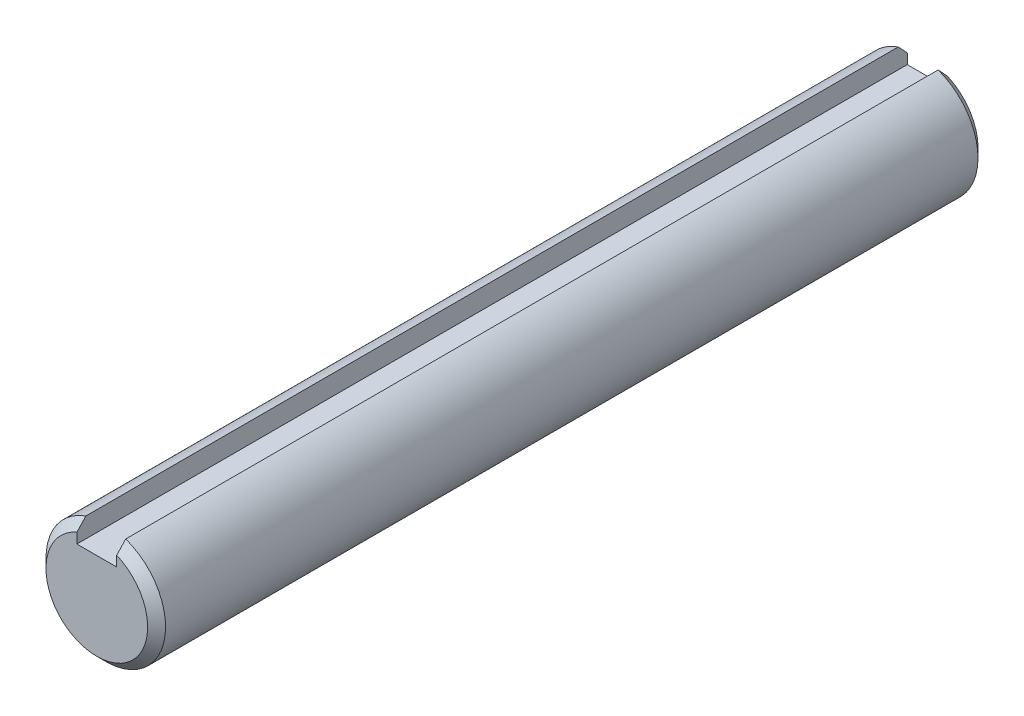
ISO-10303-21;
HEADER;
FILE_DESCRIPTION(('STEP AP214'),'2;1');
FILE_NAME('part.step','',(''),(''),'','','');
FILE_SCHEMA(('AUTOMOTIVE_DESIGN { 1 0 10303 214 1 1 1 1 }'));
ENDSEC;
DATA;
#1=APPLICATION_CONTEXT('core data for automotive mechanical design processes');
#2=APPLICATION_PROTOCOL_DEFINITION('international standard','automotive_design',2000,#1);
#3=PRODUCT_CONTEXT('',#1,'mechanical');
#4=PRODUCT('Part','Part','',(#3));
#5=PRODUCT_RELATED_PRODUCT_CATEGORY('part','',(#4));
#6=PRODUCT_DEFINITION_FORMATION('','',#4);
#7=PRODUCT_DEFINITION_CONTEXT('part definition',#1,'design');
#8=PRODUCT_DEFINITION('design','',#6,#7);
#9=PRODUCT_DEFINITION_SHAPE('','',#8);
#10=(LENGTH_UNIT() NAMED_UNIT(*) SI_UNIT(.MILLI.,.METRE.));
#11=(NAMED_UNIT(*) PLANE_ANGLE_UNIT() SI_UNIT($,.RADIAN.));
#12=(NAMED_UNIT(*) SI_UNIT($,.STERADIAN.) SOLID_ANGLE_UNIT());
#13=UNCERTAINTY_MEASURE_WITH_UNIT(LENGTH_MEASURE(1.E-05),#10,'distance_accuracy_value','');
#14=(GEOMETRIC_REPRESENTATION_CONTEXT(3) GLOBAL_UNCERTAINTY_ASSIGNED_CONTEXT((#13)) GLOBAL_UNIT_ASSIGNED_CONTEXT((#10,
#11,#12)) REPRESENTATION_CONTEXT('',''));
#15=CARTESIAN_POINT('',(0.,0.,0.));
#16=DIRECTION('',(0.,0.,1.));
#17=DIRECTION('',(1.,0.,0.));
#18=AXIS2_PLACEMENT_3D('',#15,#16,#17);
#19=CARTESIAN_POINT('',(0.,0.,62.5));
#20=DIRECTION('',(0.,0.,-1.));
#21=DIRECTION('',(-1.,0.,0.));
#22=AXIS2_PLACEMENT_3D('',#19,#20,#21);
#23=CYLINDRICAL_SURFACE('',#22,9.);
#24=CARTESIAN_POINT('',(0.,0.,61.15));
#25=DIRECTION('',(0.,0.,1.));
#26=DIRECTION('',(1.,0.,0.));
#27=AXIS2_PLACEMENT_3D('',#24,#25,#26);
#28=CIRCLE('',#27,9.);
#29=CARTESIAN_POINT('',(3.,8.48528137423857,61.15));
#30=VERTEX_POINT('',#29);
#31=CARTESIAN_POINT('',(-3.,8.48528137423857,61.15));
#32=VERTEX_POINT('',#31);
#33=EDGE_CURVE('E174',#30,#32,#28,.F.);
#34=ORIENTED_EDGE('',*,*,#33,.T.);
#35=DIRECTION('',(0.,0.,-1.));
#36=VECTOR('',#35,1.);
#37=CARTESIAN_POINT('',(-3.,8.48528137423857,62.5));
#38=LINE('',#37,#36);
#39=CARTESIAN_POINT('',(-3.,8.48528137423857,-61.15));
#40=VERTEX_POINT('',#39);
#41=EDGE_CURVE('E147',#32,#40,#38,.T.);
#42=ORIENTED_EDGE('',*,*,#41,.T.);
#43=CARTESIAN_POINT('',(0.,0.,-61.15));
#44=DIRECTION('',(0.,0.,1.));
#45=DIRECTION('',(1.,0.,0.));
#46=AXIS2_PLACEMENT_3D('',#43,#44,#45);
#47=CIRCLE('',#46,9.);
#48=CARTESIAN_POINT('',(3.,8.48528137423857,-61.15));
#49=VERTEX_POINT('',#48);
#50=EDGE_CURVE('E170',#40,#49,#47,.T.);
#51=ORIENTED_EDGE('',*,*,#50,.T.);
#52=DIRECTION('',(0.,0.,-1.));
#53=VECTOR('',#52,1.);
#54=CARTESIAN_POINT('',(3.,8.48528137423857,62.5));
#55=LINE('',#54,#53);
#56=EDGE_CURVE('E134',#49,#30,#55,.F.);
#57=ORIENTED_EDGE('',*,*,#56,.T.);
#58=EDGE_LOOP('',(#34,#42,#51,#57));
#59=FACE_BOUND('',#58,.T.);
#60=ADVANCED_FACE('F39',(#59),#23,.T.);
#61=CARTESIAN_POINT('',(0.,0.,62.5));
#62=DIRECTION('',(0.,0.,1.));
#63=DIRECTION('',(1.,0.,0.));
#64=AXIS2_PLACEMENT_3D('',#61,#62,#63);
#65=PLANE('',#64);
#66=DIRECTION('',(0.,-1.,0.));
#67=VECTOR('',#66,1.);
#68=CARTESIAN_POINT('',(-3.,9.,62.5));
#69=LINE('',#68,#67);
#70=CARTESIAN_POINT('',(-3.,7.03722246344393,62.5));
#71=VERTEX_POINT('',#70);
#72=CARTESIAN_POINT('',(-3.,5.5,62.5));
#73=VERTEX_POINT('',#72);
#74=EDGE_CURVE('E96',#71,#73,#69,.T.);
#75=ORIENTED_EDGE('',*,*,#74,.F.);
#76=CARTESIAN_POINT('',(0.,0.,62.5));
#77=DIRECTION('',(0.,0.,1.));
#78=DIRECTION('',(1.,0.,0.));
#79=AXIS2_PLACEMENT_3D('',#76,#77,#78);
#80=CIRCLE('',#79,7.64999999999999);
#81=CARTESIAN_POINT('',(3.,7.03722246344393,62.5));
#82=VERTEX_POINT('',#81);
#83=EDGE_CURVE('E163',#71,#82,#80,.T.);
#84=ORIENTED_EDGE('',*,*,#83,.T.);
#85=DIRECTION('',(0.,1.,0.));
#86=VECTOR('',#85,1.);
#87=CARTESIAN_POINT('',(3.,9.,62.5));
#88=LINE('',#87,#86);
#89=CARTESIAN_POINT('',(3.,5.5,62.5));
#90=VERTEX_POINT('',#89);
#91=EDGE_CURVE('E61',#90,#82,#88,.T.);
#92=ORIENTED_EDGE('',*,*,#91,.F.);
#93=DIRECTION('',(1.,0.,0.));
#94=VECTOR('',#93,1.);
#95=CARTESIAN_POINT('',(-3.,5.5,62.5));
#96=LINE('',#95,#94);
#97=EDGE_CURVE('E107',#73,#90,#96,.T.);
#98=ORIENTED_EDGE('',*,*,#97,.F.);
#99=EDGE_LOOP('',(#75,#84,#92,#98));
#100=FACE_BOUND('',#99,.T.);
#101=ADVANCED_FACE('F119',(#100),#65,.T.);
#102=CARTESIAN_POINT('',(0.,0.,-62.5));
#103=DIRECTION('',(0.,0.,1.));
#104=DIRECTION('',(1.,0.,0.));
#105=AXIS2_PLACEMENT_3D('',#102,#103,#104);
#106=PLANE('',#105);
#107=CARTESIAN_POINT('',(0.,0.,-62.5));
#108=DIRECTION('',(0.,0.,1.));
#109=DIRECTION('',(1.,0.,0.));
#110=AXIS2_PLACEMENT_3D('',#107,#108,#109);
#111=CIRCLE('',#110,7.64999999999998);
#112=CARTESIAN_POINT('',(3.,7.03722246344391,-62.5));
#113=VERTEX_POINT('',#112);
#114=CARTESIAN_POINT('',(-3.,7.03722246344391,-62.5));
#115=VERTEX_POINT('',#114);
#116=EDGE_CURVE('E166',#113,#115,#111,.F.);
#117=ORIENTED_EDGE('',*,*,#116,.T.);
#118=DIRECTION('',(0.,-1.,0.));
#119=VECTOR('',#118,1.);
#120=CARTESIAN_POINT('',(-3.,9.,-62.5));
#121=LINE('',#120,#119);
#122=CARTESIAN_POINT('',(-3.,5.5,-62.5));
#123=VERTEX_POINT('',#122);
#124=EDGE_CURVE('E123',#115,#123,#121,.T.);
#125=ORIENTED_EDGE('',*,*,#124,.T.);
#126=DIRECTION('',(1.,0.,0.));
#127=VECTOR('',#126,1.);
#128=CARTESIAN_POINT('',(-3.,5.5,-62.5));
#129=LINE('',#128,#127);
#130=CARTESIAN_POINT('',(3.,5.5,-62.5));
#131=VERTEX_POINT('',#130);
#132=EDGE_CURVE('E113',#123,#131,#129,.T.);
#133=ORIENTED_EDGE('',*,*,#132,.T.);
#134=DIRECTION('',(0.,1.,0.));
#135=VECTOR('',#134,1.);
#136=CARTESIAN_POINT('',(3.,9.,-62.5));
#137=LINE('',#136,#135);
#138=EDGE_CURVE('E117',#131,#113,#137,.T.);
#139=ORIENTED_EDGE('',*,*,#138,.T.);
#140=EDGE_LOOP('',(#117,#125,#133,#139));
#141=FACE_BOUND('',#140,.T.);
#142=ADVANCED_FACE('F188',(#141),#106,.F.);
#143=CARTESIAN_POINT('',(0.,0.,-61.15));
#144=DIRECTION('',(0.,0.,1.));
#145=DIRECTION('',(1.,0.,0.));
#146=AXIS2_PLACEMENT_3D('',#143,#144,#145);
#147=CONICAL_SURFACE('',#146,9.,0.78539816339745);
#148=CARTESIAN_POINT('',(-3.,1.28705422175552,-66.885569181352));
#149=CARTESIAN_POINT('',(-3.,1.39416593494413,-66.8432894280085));
#150=CARTESIAN_POINT('',(-3.,1.49970504612448,-66.7972735018724));
#151=CARTESIAN_POINT('',(-3.,1.70779483974035,-66.6991939067308));
#152=CARTESIAN_POINT('',(-3.,1.81034895326579,-66.6471375544168));
#153=CARTESIAN_POINT('',(-3.,2.01250497376191,-66.5384958636934));
#154=CARTESIAN_POINT('',(-3.,2.11211642904182,-66.4819280604578));
#155=CARTESIAN_POINT('',(-3.,2.30915207895779,-66.3650446883122));
#156=CARTESIAN_POINT('',(-3.,2.40657551522026,-66.3047278464544));
#157=CARTESIAN_POINT('',(-3.,2.59888060566875,-66.181528445959));
#158=CARTESIAN_POINT('',(-3.,2.69377470407571,-66.11866521502));
#159=CARTESIAN_POINT('',(-3.,2.88195057215747,-65.9905648359847));
#160=CARTESIAN_POINT('',(-3.,2.9752322255786,-65.9253275177663));
#161=CARTESIAN_POINT('',(-3.,3.25321336712594,-65.7265952545667));
#162=CARTESIAN_POINT('',(-3.,3.43584713067468,-65.590212049234));
#163=CARTESIAN_POINT('',(-3.,3.77483382970658,-65.3292923578594));
#164=CARTESIAN_POINT('',(-3.,3.93165748800274,-65.2053606149217));
#165=CARTESIAN_POINT('',(-3.,4.24287389988172,-64.9544735379188));
#166=CARTESIAN_POINT('',(-3.,4.39726656021094,-64.8275180883307));
#167=CARTESIAN_POINT('',(-3.,4.70407768227169,-64.5713596310665));
#168=CARTESIAN_POINT('',(-3.,4.85649681879047,-64.4421574290075));
#169=CARTESIAN_POINT('',(-3.,5.15980015980948,-64.1819612267925));
#170=CARTESIAN_POINT('',(-3.,5.31068433581819,-64.0509671934824));
#171=CARTESIAN_POINT('',(-3.,5.76315575248961,-63.6544132772478));
#172=CARTESIAN_POINT('',(-3.,6.06286560171806,-63.3867128344436));
#173=CARTESIAN_POINT('',(-3.,6.65892063625382,-62.8475897040517));
#174=CARTESIAN_POINT('',(-3.,6.95526570481031,-62.5761668880225));
#175=CARTESIAN_POINT('',(-3.,7.48087483441551,-62.0904865625212));
#176=CARTESIAN_POINT('',(-3.,7.71060801951142,-61.8767360336497));
#177=CARTESIAN_POINT('',(-3.,8.16891776669348,-61.4480072910026));
#178=CARTESIAN_POINT('',(-3.,8.39749434809234,-61.2330290978547));
#179=CARTESIAN_POINT('',(-3.,9.08186503993764,-60.5866507131353));
#180=CARTESIAN_POINT('',(-3.,9.53629737415059,-60.153809245877));
#181=CARTESIAN_POINT('',(-3.,10.4379308864423,-59.2902613941763));
#182=CARTESIAN_POINT('',(-3.,10.8851574882398,-58.8595814956815));
#183=CARTESIAN_POINT('',(-3.,11.5547479712263,-58.2122881220791));
#184=CARTESIAN_POINT('',(-3.,11.7777321033367,-57.9963157535234));
#185=CARTESIAN_POINT('',(-3.,12.2233453796936,-57.5640051793112));
#186=CARTESIAN_POINT('',(-3.,12.4459745240256,-57.3476669737429));
#187=CARTESIAN_POINT('',(-3.,12.6684554624875,-57.1311765583434));
#188=B_SPLINE_CURVE_WITH_KNOTS('',3,(#148,#149,#150,#151,#152,#153,#154,#155,#156,#157,#158,
#159,#160,#161,#162,#163,#164,#165,#166,#167,#168,#169,#170,#171,#172,#173,#174,#175,#176,#177,
#178,#179,#180,#181,#182,#183,#184,#185,#186,#187),.UNSPECIFIED.,.F.,.F.,(4,2,2,2,2,2,2,2,2,2,2,
2,2,2,2,2,2,2,2,4),(0.,0.345260517163666,0.690107106476345,1.0336731835684,1.37735655910374,
1.71879551786006,2.06025899178169,2.74390904952977,3.34351590462932,3.94314570501065,
4.5425647573687,5.14199491575397,6.34751226495429,7.55307131602838,8.49444752726594,
9.4358079673907,11.3185399991295,13.1811862611621,14.1124720431243,15.0437576004991),.UNSPECIFIED.);
#189=EDGE_CURVE('E69',#115,#40,#188,.T.);
#190=ORIENTED_EDGE('',*,*,#189,.F.);
#191=ORIENTED_EDGE('',*,*,#116,.F.);
#192=CARTESIAN_POINT('',(3.,12.6684554624875,-57.1311765583434));
#193=CARTESIAN_POINT('',(3.,12.4443629858942,-57.3492350925374));
#194=CARTESIAN_POINT('',(3.,12.2201201695381,-57.5671392208842));
#195=CARTESIAN_POINT('',(3.,11.7712744081235,-58.0025754232811));
#196=CARTESIAN_POINT('',(3.,11.5466714637079,-58.220107497994));
#197=CARTESIAN_POINT('',(3.,10.8725460583514,-58.871748423888));
#198=CARTESIAN_POINT('',(3.,10.4223942062384,-59.3052067103101));
#199=CARTESIAN_POINT('',(3.,9.52101749576605,-60.1683756665244));
#200=CARTESIAN_POINT('',(3.,9.06979958531305,-60.5980935757919));
#201=CARTESIAN_POINT('',(3.,8.3901259623755,-61.239964360573));
#202=CARTESIAN_POINT('',(3.,8.16301630644125,-61.4535420787142));
#203=CARTESIAN_POINT('',(3.,7.70764902442766,-61.8794894813408));
#204=CARTESIAN_POINT('',(3.,7.47939135327407,-62.0918591176848));
#205=CARTESIAN_POINT('',(3.,7.02013555419467,-62.5162232094383));
#206=CARTESIAN_POINT('',(3.,6.78912923162492,-62.7282088058439));
#207=CARTESIAN_POINT('',(3.,6.3252355250844,-63.1500519451756));
#208=CARTESIAN_POINT('',(3.,6.09234840304178,-63.359909775546));
#209=CARTESIAN_POINT('',(3.,5.62444332287705,-63.7763822232414));
#210=CARTESIAN_POINT('',(3.,5.38942998766917,-63.9830020258882));
#211=CARTESIAN_POINT('',(3.,4.91579369350942,-64.3923329885421));
#212=CARTESIAN_POINT('',(3.,4.67716896563096,-64.5950421146631));
#213=CARTESIAN_POINT('',(3.,4.31477214811534,-64.8952218033121));
#214=CARTESIAN_POINT('',(3.,4.19285453818266,-64.9949298427842));
#215=CARTESIAN_POINT('',(3.,3.94749315778375,-65.1924413885736));
#216=CARTESIAN_POINT('',(3.,3.82404946978754,-65.2902449970781));
#217=CARTESIAN_POINT('',(3.,3.57547725617887,-65.4833183260671));
#218=CARTESIAN_POINT('',(3.,3.45035142568918,-65.5785915068673));
#219=CARTESIAN_POINT('',(3.,3.19778471242301,-65.7660908490711));
#220=CARTESIAN_POINT('',(3.,3.07034333229034,-65.8583163435805));
#221=CARTESIAN_POINT('',(3.,2.811744169512,-66.039365351446));
#222=CARTESIAN_POINT('',(3.,2.68056683526167,-66.1281610577359));
#223=CARTESIAN_POINT('',(3.,2.4147212106069,-66.3002469626776));
#224=CARTESIAN_POINT('',(3.,2.2800551492524,-66.3835405616245));
#225=CARTESIAN_POINT('',(3.,2.07443625756609,-66.5030599403073));
#226=CARTESIAN_POINT('',(3.,2.00511170562078,-66.5420888626211));
#227=CARTESIAN_POINT('',(3.,1.86525443696877,-66.6179017481584));
#228=CARTESIAN_POINT('',(3.,1.79472190356853,-66.6546860481961));
#229=CARTESIAN_POINT('',(3.,1.65218360515421,-66.725692751653));
#230=CARTESIAN_POINT('',(3.,1.5801750399255,-66.7599095724919));
#231=CARTESIAN_POINT('',(3.,1.43471110691234,-66.8252160061861));
#232=CARTESIAN_POINT('',(3.,1.36125498684718,-66.8563039388428));
#233=CARTESIAN_POINT('',(3.,1.28705422175552,-66.885569181352));
#234=B_SPLINE_CURVE_WITH_KNOTS('',3,(#192,#193,#194,#195,#196,#197,#198,#199,#200,#201,#202,
#203,#204,#205,#206,#207,#208,#209,#210,#211,#212,#213,#214,#215,#216,#217,#218,#219,#220,#221,
#222,#223,#224,#225,#226,#227,#228,#229,#230,#231,#232,#233),.UNSPECIFIED.,.F.,.F.,(4,2,2,2,2,2,
2,2,2,2,2,2,2,2,2,2,2,2,2,2,4),(0.,0.938031249020088,1.87606082527993,3.75080984684274,
5.62009648450805,6.55537289706372,7.49068632238736,8.43127072482423,9.37172632187256,
10.3104787015687,11.2497068219196,11.7221862809691,12.1946403176433,12.6664110152082,
13.1382842710489,13.613407650853,14.0882346035914,14.3268694808719,14.5654684615732,
14.8045720461496,15.0438033507551),.UNSPECIFIED.);
#235=EDGE_CURVE('E139',#49,#113,#234,.T.);
#236=ORIENTED_EDGE('',*,*,#235,.F.);
#237=ORIENTED_EDGE('',*,*,#50,.F.);
#238=EDGE_LOOP('',(#190,#191,#236,#237));
#239=FACE_BOUND('',#238,.T.);
#240=ADVANCED_FACE('F149',(#239),#147,.T.);
#241=CARTESIAN_POINT('',(0.,0.,62.5));
#242=DIRECTION('',(0.,0.,-1.));
#243=DIRECTION('',(-1.,0.,0.));
#244=AXIS2_PLACEMENT_3D('',#241,#242,#243);
#245=CONICAL_SURFACE('',#244,7.64999999999999,0.785398163397455);
#246=CARTESIAN_POINT('',(-3.,12.6684554624874,57.1311765583434));
#247=CARTESIAN_POINT('',(-3.,12.4443629858941,57.3492350925375));
#248=CARTESIAN_POINT('',(-3.,12.2201201695381,57.5671392208843));
#249=CARTESIAN_POINT('',(-3.,11.7712744081235,58.0025754232811));
#250=CARTESIAN_POINT('',(-3.,11.5466714637079,58.220107497994));
#251=CARTESIAN_POINT('',(-3.,10.8725460583513,58.8717484238881));
#252=CARTESIAN_POINT('',(-3.,10.4223942062384,59.3052067103102));
#253=CARTESIAN_POINT('',(-3.,9.52101749576605,60.1683756665245));
#254=CARTESIAN_POINT('',(-3.,9.06979958531304,60.598093575792));
#255=CARTESIAN_POINT('',(-3.,8.3901259623755,61.239964360573));
#256=CARTESIAN_POINT('',(-3.,8.16301630644124,61.4535420787142));
#257=CARTESIAN_POINT('',(-3.,7.70764902442766,61.8794894813408));
#258=CARTESIAN_POINT('',(-3.,7.47939135327407,62.0918591176848));
#259=CARTESIAN_POINT('',(-3.,7.02013555419467,62.5162232094383));
#260=CARTESIAN_POINT('',(-3.,6.78912923162492,62.7282088058439));
#261=CARTESIAN_POINT('',(-3.,6.32523552508441,63.1500519451756));
#262=CARTESIAN_POINT('',(-3.,6.09234840304178,63.359909775546));
#263=CARTESIAN_POINT('',(-3.,5.62444332287705,63.7763822232414));
#264=CARTESIAN_POINT('',(-3.,5.38942998766917,63.9830020258882));
#265=CARTESIAN_POINT('',(-3.,4.91579369350942,64.392332988542));
#266=CARTESIAN_POINT('',(-3.,4.67716896563096,64.595042114663));
#267=CARTESIAN_POINT('',(-3.,4.31477214811535,64.8952218033121));
#268=CARTESIAN_POINT('',(-3.,4.19285453818267,64.9949298427842));
#269=CARTESIAN_POINT('',(-3.,3.94749315778376,65.1924413885736));
#270=CARTESIAN_POINT('',(-3.,3.82404946978755,65.2902449970781));
#271=CARTESIAN_POINT('',(-3.,3.57547725617888,65.4833183260671));
#272=CARTESIAN_POINT('',(-3.,3.4503514256892,65.5785915068672));
#273=CARTESIAN_POINT('',(-3.,3.19778471242302,65.7660908490711));
#274=CARTESIAN_POINT('',(-3.,3.07034333229035,65.8583163435805));
#275=CARTESIAN_POINT('',(-3.,2.811744169512,66.0393653514459));
#276=CARTESIAN_POINT('',(-3.,2.68056683526167,66.1281610577358));
#277=CARTESIAN_POINT('',(-3.,2.4147212106069,66.3002469626776));
#278=CARTESIAN_POINT('',(-3.,2.2800551492524,66.3835405616245));
#279=CARTESIAN_POINT('',(-3.,2.0744362575661,66.5030599403072));
#280=CARTESIAN_POINT('',(-3.,2.00511170562079,66.542088862621));
#281=CARTESIAN_POINT('',(-3.,1.86525443696878,66.6179017481583));
#282=CARTESIAN_POINT('',(-3.,1.79472190356854,66.654686048196));
#283=CARTESIAN_POINT('',(-3.,1.65218360515422,66.7256927516529));
#284=CARTESIAN_POINT('',(-3.,1.58017503992552,66.7599095724919));
#285=CARTESIAN_POINT('',(-3.,1.43471110691236,66.825216006186));
#286=CARTESIAN_POINT('',(-3.,1.3612549868472,66.8563039388428));
#287=CARTESIAN_POINT('',(-3.,1.28705422175553,66.8855691813519));
#288=B_SPLINE_CURVE_WITH_KNOTS('',3,(#246,#247,#248,#249,#250,#251,#252,#253,#254,#255,#256,
#257,#258,#259,#260,#261,#262,#263,#264,#265,#266,#267,#268,#269,#270,#271,#272,#273,#274,#275,
#276,#277,#278,#279,#280,#281,#282,#283,#284,#285,#286,#287),.UNSPECIFIED.,.F.,.F.,(4,2,2,2,2,2,
2,2,2,2,2,2,2,2,2,2,2,2,2,2,4),(0.,0.938031249020085,1.87606082527992,3.75080984684271,
5.62009648450801,6.55537289706368,7.49068632238732,8.43127072482417,9.37172632187249,
10.3104787015687,11.2497068219195,11.722186280969,12.1946403176432,12.6664110152081,
13.1382842710488,13.6134076508529,14.0882346035914,14.3268694808718,14.5654684615731,
14.8045720461495,15.043803350755),.UNSPECIFIED.);
#289=EDGE_CURVE('E11',#32,#71,#288,.T.);
#290=ORIENTED_EDGE('',*,*,#289,.F.);
#291=ORIENTED_EDGE('',*,*,#33,.F.);
#292=CARTESIAN_POINT('',(3.,1.28705422175553,66.8855691813519));
#293=CARTESIAN_POINT('',(3.,1.39416593494415,66.8432894280085));
#294=CARTESIAN_POINT('',(3.,1.4997050461245,66.7972735018724));
#295=CARTESIAN_POINT('',(3.,1.70779483974037,66.6991939067307));
#296=CARTESIAN_POINT('',(3.,1.81034895326582,66.6471375544167));
#297=CARTESIAN_POINT('',(3.,2.01250497376194,66.5384958636934));
#298=CARTESIAN_POINT('',(3.,2.11211642904184,66.4819280604578));
#299=CARTESIAN_POINT('',(3.,2.30915207895782,66.3650446883121));
#300=CARTESIAN_POINT('',(3.,2.40657551522028,66.3047278464543));
#301=CARTESIAN_POINT('',(3.,2.59888060566878,66.181528445959));
#302=CARTESIAN_POINT('',(3.,2.69377470407574,66.1186652150199));
#303=CARTESIAN_POINT('',(3.,2.88195057215751,65.9905648359846));
#304=CARTESIAN_POINT('',(3.,2.97523222557864,65.9253275177663));
#305=CARTESIAN_POINT('',(3.,3.25321336712598,65.7265952545666));
#306=CARTESIAN_POINT('',(3.,3.43584713067472,65.590212049234));
#307=CARTESIAN_POINT('',(3.,3.77483382970662,65.3292923578593));
#308=CARTESIAN_POINT('',(3.,3.93165748800278,65.2053606149217));
#309=CARTESIAN_POINT('',(3.,4.24287389988174,64.9544735379188));
#310=CARTESIAN_POINT('',(3.,4.39726656021097,64.8275180883307));
#311=CARTESIAN_POINT('',(3.,4.70407768227171,64.5713596310664));
#312=CARTESIAN_POINT('',(3.,4.85649681879049,64.4421574290074));
#313=CARTESIAN_POINT('',(3.,5.1598001598095,64.1819612267924));
#314=CARTESIAN_POINT('',(3.,5.3106843358182,64.0509671934824));
#315=CARTESIAN_POINT('',(3.,5.76315575248963,63.6544132772478));
#316=CARTESIAN_POINT('',(3.,6.06286560171807,63.3867128344436));
#317=CARTESIAN_POINT('',(3.,6.65892063625382,62.8475897040517));
#318=CARTESIAN_POINT('',(3.,6.95526570481031,62.5761668880225));
#319=CARTESIAN_POINT('',(3.,7.4808748344155,62.0904865625213));
#320=CARTESIAN_POINT('',(3.,7.71060801951141,61.8767360336497));
#321=CARTESIAN_POINT('',(3.,8.16891776669347,61.4480072910026));
#322=CARTESIAN_POINT('',(3.,8.39749434809233,61.2330290978547));
#323=CARTESIAN_POINT('',(3.,9.08186503993762,60.5866507131354));
#324=CARTESIAN_POINT('',(3.,9.53629737415058,60.153809245877));
#325=CARTESIAN_POINT('',(3.,10.4379308864423,59.2902613941763));
#326=CARTESIAN_POINT('',(3.,10.8851574882398,58.8595814956816));
#327=CARTESIAN_POINT('',(3.,11.5547479712262,58.2122881220792));
#328=CARTESIAN_POINT('',(3.,11.7777321033367,57.9963157535235));
#329=CARTESIAN_POINT('',(3.,12.2233453796936,57.5640051793113));
#330=CARTESIAN_POINT('',(3.,12.4459745240255,57.347666973743));
#331=CARTESIAN_POINT('',(3.,12.6684554624874,57.1311765583434));
#332=B_SPLINE_CURVE_WITH_KNOTS('',3,(#292,#293,#294,#295,#296,#297,#298,#299,#300,#301,#302,
#303,#304,#305,#306,#307,#308,#309,#310,#311,#312,#313,#314,#315,#316,#317,#318,#319,#320,#321,
#322,#323,#324,#325,#326,#327,#328,#329,#330,#331),.UNSPECIFIED.,.F.,.F.,(4,2,2,2,2,2,2,2,2,2,2,
2,2,2,2,2,2,2,2,4),(0.,0.345260517163663,0.690107106476357,1.03367318356841,1.37735655910376,
1.71879551786008,2.06025899178171,2.7439090495298,3.34351590462933,3.94314570501065,
4.5425647573687,5.14199491575396,6.34751226495426,7.55307131602833,8.49444752726588,
9.43580796739063,11.3185399991294,13.181186261162,14.1124720431242,15.043757600499),.UNSPECIFIED.);
#333=EDGE_CURVE('E54',#82,#30,#332,.T.);
#334=ORIENTED_EDGE('',*,*,#333,.F.);
#335=ORIENTED_EDGE('',*,*,#83,.F.);
#336=EDGE_LOOP('',(#290,#291,#334,#335));
#337=FACE_BOUND('',#336,.T.);
#338=ADVANCED_FACE('F41',(#337),#245,.T.);
#339=CARTESIAN_POINT('',(-3.,9.,-62.5));
#340=DIRECTION('',(-1.,0.,0.));
#341=DIRECTION('',(0.,-1.,0.));
#342=AXIS2_PLACEMENT_3D('',#339,#340,#341);
#343=PLANE('',#342);
#344=ORIENTED_EDGE('',*,*,#189,.T.);
#345=ORIENTED_EDGE('',*,*,#41,.F.);
#346=ORIENTED_EDGE('',*,*,#289,.T.);
#347=ORIENTED_EDGE('',*,*,#74,.T.);
#348=DIRECTION('',(0.,0.,1.));
#349=VECTOR('',#348,1.);
#350=CARTESIAN_POINT('',(-3.,5.5,-62.5));
#351=LINE('',#350,#349);
#352=EDGE_CURVE('E99',#123,#73,#351,.T.);
#353=ORIENTED_EDGE('',*,*,#352,.F.);
#354=ORIENTED_EDGE('',*,*,#124,.F.);
#355=EDGE_LOOP('',(#344,#345,#346,#347,#353,#354));
#356=FACE_BOUND('',#355,.T.);
#357=ADVANCED_FACE('F98',(#356),#343,.F.);
#358=CARTESIAN_POINT('',(3.,9.,-62.5));
#359=DIRECTION('',(1.,0.,0.));
#360=DIRECTION('',(0.,1.,0.));
#361=AXIS2_PLACEMENT_3D('',#358,#359,#360);
#362=PLANE('',#361);
#363=ORIENTED_EDGE('',*,*,#235,.T.);
#364=ORIENTED_EDGE('',*,*,#138,.F.);
#365=DIRECTION('',(0.,0.,1.));
#366=VECTOR('',#365,1.);
#367=CARTESIAN_POINT('',(3.,5.5,-62.5));
#368=LINE('',#367,#366);
#369=EDGE_CURVE('E116',#131,#90,#368,.T.);
#370=ORIENTED_EDGE('',*,*,#369,.T.);
#371=ORIENTED_EDGE('',*,*,#91,.T.);
#372=ORIENTED_EDGE('',*,*,#333,.T.);
#373=ORIENTED_EDGE('',*,*,#56,.F.);
#374=EDGE_LOOP('',(#363,#364,#370,#371,#372,#373));
#375=FACE_BOUND('',#374,.T.);
#376=ADVANCED_FACE('F152',(#375),#362,.F.);
#377=CARTESIAN_POINT('',(-3.,5.5,-62.5));
#378=DIRECTION('',(0.,-1.,0.));
#379=DIRECTION('',(0.,0.,-1.));
#380=AXIS2_PLACEMENT_3D('',#377,#378,#379);
#381=PLANE('',#380);
#382=ORIENTED_EDGE('',*,*,#369,.F.);
#383=ORIENTED_EDGE('',*,*,#132,.F.);
#384=ORIENTED_EDGE('',*,*,#352,.T.);
#385=ORIENTED_EDGE('',*,*,#97,.T.);
#386=EDGE_LOOP('',(#382,#383,#384,#385));
#387=FACE_BOUND('',#386,.T.);
#388=ADVANCED_FACE('F111',(#387),#381,.F.);
#389=CLOSED_SHELL('',(#60,#101,#142,#240,#338,#357,#376,#388));
#390=MANIFOLD_SOLID_BREP('B2',#389);
#391=ADVANCED_BREP_SHAPE_REPRESENTATION('',(#18,#390),#14);
#392=SHAPE_DEFINITION_REPRESENTATION(#9,#391);
ENDSEC;
END-ISO-10303-21;
